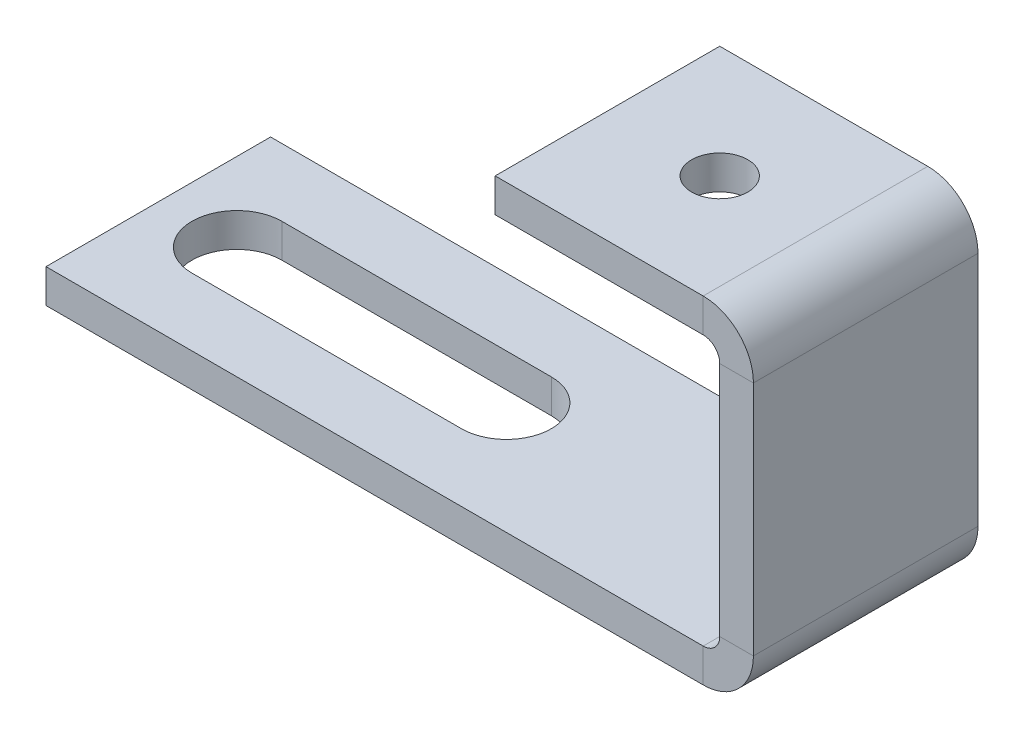
ISO-10303-21;
HEADER;
FILE_DESCRIPTION(('STEP AP214'),'2;1');
FILE_NAME('part.step','',(''),(''),'','','');
FILE_SCHEMA(('AUTOMOTIVE_DESIGN { 1 0 10303 214 1 1 1 1 }'));
ENDSEC;
DATA;
#1=APPLICATION_CONTEXT('core data for automotive mechanical design processes');
#2=APPLICATION_PROTOCOL_DEFINITION('international standard','automotive_design',2000,#1);
#3=PRODUCT_CONTEXT('',#1,'mechanical');
#4=PRODUCT('Part','Part','',(#3));
#5=PRODUCT_RELATED_PRODUCT_CATEGORY('part','',(#4));
#6=PRODUCT_DEFINITION_FORMATION('','',#4);
#7=PRODUCT_DEFINITION_CONTEXT('part definition',#1,'design');
#8=PRODUCT_DEFINITION('design','',#6,#7);
#9=PRODUCT_DEFINITION_SHAPE('','',#8);
#10=(LENGTH_UNIT() NAMED_UNIT(*) SI_UNIT(.MILLI.,.METRE.));
#11=(NAMED_UNIT(*) PLANE_ANGLE_UNIT() SI_UNIT($,.RADIAN.));
#12=(NAMED_UNIT(*) SI_UNIT($,.STERADIAN.) SOLID_ANGLE_UNIT());
#13=UNCERTAINTY_MEASURE_WITH_UNIT(LENGTH_MEASURE(1.E-05),#10,'distance_accuracy_value','');
#14=(GEOMETRIC_REPRESENTATION_CONTEXT(3) GLOBAL_UNCERTAINTY_ASSIGNED_CONTEXT((#13)) GLOBAL_UNIT_ASSIGNED_CONTEXT((#10,
#11,#12)) REPRESENTATION_CONTEXT('',''));
#15=CARTESIAN_POINT('',(0.,0.,0.));
#16=DIRECTION('',(0.,0.,1.));
#17=DIRECTION('',(1.,0.,0.));
#18=AXIS2_PLACEMENT_3D('',#15,#16,#17);
#19=CARTESIAN_POINT('',(0.,-1.5,10.));
#20=DIRECTION('',(0.,1.,0.));
#21=DIRECTION('',(-1.,0.,0.));
#22=AXIS2_PLACEMENT_3D('',#19,#20,#21);
#23=PLANE('',#22);
#24=DIRECTION('',(1.,0.,0.));
#25=VECTOR('',#24,1.);
#26=CARTESIAN_POINT('',(0.,-1.5,0.));
#27=LINE('',#26,#25);
#28=CARTESIAN_POINT('',(-30.,-1.5,0.));
#29=VERTEX_POINT('',#28);
#30=CARTESIAN_POINT('',(-0.7366,-1.5,0.));
#31=VERTEX_POINT('',#30);
#32=EDGE_CURVE('E205',#29,#31,#27,.T.);
#33=ORIENTED_EDGE('',*,*,#32,.T.);
#34=DIRECTION('',(0.,0.,-1.));
#35=VECTOR('',#34,1.);
#36=CARTESIAN_POINT('',(-0.7366,-1.5,10.));
#37=LINE('',#36,#35);
#38=CARTESIAN_POINT('',(-0.7366,-1.5,10.));
#39=VERTEX_POINT('',#38);
#40=EDGE_CURVE('E169',#39,#31,#37,.T.);
#41=ORIENTED_EDGE('',*,*,#40,.F.);
#42=DIRECTION('',(1.,0.,0.));
#43=VECTOR('',#42,1.);
#44=CARTESIAN_POINT('',(0.,-1.5,10.));
#45=LINE('',#44,#43);
#46=CARTESIAN_POINT('',(-30.,-1.5,10.));
#47=VERTEX_POINT('',#46);
#48=EDGE_CURVE('E158',#47,#39,#45,.T.);
#49=ORIENTED_EDGE('',*,*,#48,.F.);
#50=DIRECTION('',(0.,0.,-1.));
#51=VECTOR('',#50,1.);
#52=CARTESIAN_POINT('',(-30.,-1.5,10.));
#53=LINE('',#52,#51);
#54=EDGE_CURVE('E217',#47,#29,#53,.T.);
#55=ORIENTED_EDGE('',*,*,#54,.T.);
#56=EDGE_LOOP('',(#33,#41,#49,#55));
#57=FACE_BOUND('',#56,.T.);
#58=DIRECTION('',(1.,0.,0.));
#59=VECTOR('',#58,1.);
#60=CARTESIAN_POINT('',(0.,-1.5,7.));
#61=LINE('',#60,#59);
#62=CARTESIAN_POINT('',(-26.5,-1.5,7.));
#63=VERTEX_POINT('',#62);
#64=CARTESIAN_POINT('',(-14.5,-1.5,7.));
#65=VERTEX_POINT('',#64);
#66=EDGE_CURVE('E288',#63,#65,#61,.T.);
#67=ORIENTED_EDGE('',*,*,#66,.T.);
#68=CARTESIAN_POINT('',(-14.5,-1.5,5.));
#69=DIRECTION('',(0.,1.,0.));
#70=DIRECTION('',(-1.,0.,0.));
#71=AXIS2_PLACEMENT_3D('',#68,#69,#70);
#72=CIRCLE('',#71,2.);
#73=CARTESIAN_POINT('',(-14.5,-1.5,3.));
#74=VERTEX_POINT('',#73);
#75=EDGE_CURVE('E284',#65,#74,#72,.T.);
#76=ORIENTED_EDGE('',*,*,#75,.T.);
#77=DIRECTION('',(-1.,0.,0.));
#78=VECTOR('',#77,1.);
#79=CARTESIAN_POINT('',(0.,-1.5,3.));
#80=LINE('',#79,#78);
#81=CARTESIAN_POINT('',(-26.5,-1.5,3.));
#82=VERTEX_POINT('',#81);
#83=EDGE_CURVE('E51',#74,#82,#80,.T.);
#84=ORIENTED_EDGE('',*,*,#83,.T.);
#85=CARTESIAN_POINT('',(-26.5,-1.5,5.));
#86=DIRECTION('',(0.,1.,0.));
#87=DIRECTION('',(-1.,0.,0.));
#88=AXIS2_PLACEMENT_3D('',#85,#86,#87);
#89=CIRCLE('',#88,2.);
#90=EDGE_CURVE('E286',#82,#63,#89,.T.);
#91=ORIENTED_EDGE('',*,*,#90,.T.);
#92=EDGE_LOOP('',(#67,#76,#84,#91));
#93=FACE_BOUND('',#92,.T.);
#94=ADVANCED_FACE('F36',(#57,#93),#23,.F.);
#95=CARTESIAN_POINT('',(0.,0.7366,10.));
#96=DIRECTION('',(0.,0.,1.));
#97=DIRECTION('',(1.,0.,0.));
#98=AXIS2_PLACEMENT_3D('',#95,#96,#97);
#99=PLANE('',#98);
#100=DIRECTION('',(1.,0.,0.));
#101=VECTOR('',#100,1.);
#102=CARTESIAN_POINT('',(0.,0.7366,10.));
#103=LINE('',#102,#101);
#104=CARTESIAN_POINT('',(0.,0.7366,10.));
#105=VERTEX_POINT('',#104);
#106=CARTESIAN_POINT('',(1.5,0.7366,10.));
#107=VERTEX_POINT('',#106);
#108=EDGE_CURVE('E11',#105,#107,#103,.T.);
#109=ORIENTED_EDGE('',*,*,#108,.F.);
#110=CARTESIAN_POINT('',(-0.7366,0.7366,10.));
#111=DIRECTION('',(0.,0.,-1.));
#112=DIRECTION('',(-1.,0.,0.));
#113=AXIS2_PLACEMENT_3D('',#110,#111,#112);
#114=CIRCLE('',#113,0.7366);
#115=CARTESIAN_POINT('',(-0.7366,0.,10.));
#116=VERTEX_POINT('',#115);
#117=EDGE_CURVE('E259',#116,#105,#114,.F.);
#118=ORIENTED_EDGE('',*,*,#117,.F.);
#119=DIRECTION('',(0.,1.,0.));
#120=VECTOR('',#119,1.);
#121=CARTESIAN_POINT('',(-0.7366,-1.5,10.));
#122=LINE('',#121,#120);
#123=EDGE_CURVE('E44',#39,#116,#122,.T.);
#124=ORIENTED_EDGE('',*,*,#123,.F.);
#125=CARTESIAN_POINT('',(-0.7366,0.7366,10.));
#126=DIRECTION('',(0.,0.,1.));
#127=DIRECTION('',(1.,0.,0.));
#128=AXIS2_PLACEMENT_3D('',#125,#126,#127);
#129=CIRCLE('',#128,2.2366);
#130=EDGE_CURVE('E153',#39,#107,#129,.T.);
#131=ORIENTED_EDGE('',*,*,#130,.T.);
#132=EDGE_LOOP('',(#109,#118,#124,#131));
#133=FACE_BOUND('',#132,.T.);
#134=ADVANCED_FACE('F38',(#133),#99,.T.);
#135=CARTESIAN_POINT('',(-0.7366,-1.5,10.));
#136=DIRECTION('',(0.,0.,1.));
#137=DIRECTION('',(1.,0.,0.));
#138=AXIS2_PLACEMENT_3D('',#135,#136,#137);
#139=PLANE('',#138);
#140=DIRECTION('',(0.,1.,0.));
#141=VECTOR('',#140,1.);
#142=CARTESIAN_POINT('',(0.,12.,10.));
#143=LINE('',#142,#141);
#144=CARTESIAN_POINT('',(0.,11.2634,10.));
#145=VERTEX_POINT('',#144);
#146=EDGE_CURVE('E147',#105,#145,#143,.T.);
#147=ORIENTED_EDGE('',*,*,#146,.F.);
#148=ORIENTED_EDGE('',*,*,#108,.T.);
#149=DIRECTION('',(0.,1.,0.));
#150=VECTOR('',#149,1.);
#151=CARTESIAN_POINT('',(1.5,12.,10.));
#152=LINE('',#151,#150);
#153=CARTESIAN_POINT('',(1.5,11.2634,10.));
#154=VERTEX_POINT('',#153);
#155=EDGE_CURVE('E144',#107,#154,#152,.T.);
#156=ORIENTED_EDGE('',*,*,#155,.T.);
#157=DIRECTION('',(-1.,0.,0.));
#158=VECTOR('',#157,1.);
#159=CARTESIAN_POINT('',(1.5,11.2634,10.));
#160=LINE('',#159,#158);
#161=EDGE_CURVE('E240',#154,#145,#160,.T.);
#162=ORIENTED_EDGE('',*,*,#161,.T.);
#163=EDGE_LOOP('',(#147,#148,#156,#162));
#164=FACE_BOUND('',#163,.T.);
#165=ADVANCED_FACE('F142',(#164),#139,.T.);
#166=CARTESIAN_POINT('',(-0.7366,0.,0.));
#167=DIRECTION('',(0.,0.,-1.));
#168=DIRECTION('',(-1.,0.,0.));
#169=AXIS2_PLACEMENT_3D('',#166,#167,#168);
#170=PLANE('',#169);
#171=DIRECTION('',(0.,-1.,0.));
#172=VECTOR('',#171,1.);
#173=CARTESIAN_POINT('',(-0.7366,0.,0.));
#174=LINE('',#173,#172);
#175=CARTESIAN_POINT('',(-0.7366,0.,0.));
#176=VERTEX_POINT('',#175);
#177=EDGE_CURVE('E245',#176,#31,#174,.T.);
#178=ORIENTED_EDGE('',*,*,#177,.F.);
#179=CARTESIAN_POINT('',(-0.7366,0.7366,0.));
#180=DIRECTION('',(0.,0.,-1.));
#181=DIRECTION('',(-1.,0.,0.));
#182=AXIS2_PLACEMENT_3D('',#179,#180,#181);
#183=CIRCLE('',#182,0.7366);
#184=CARTESIAN_POINT('',(0.,0.7366,0.));
#185=VERTEX_POINT('',#184);
#186=EDGE_CURVE('E196',#176,#185,#183,.F.);
#187=ORIENTED_EDGE('',*,*,#186,.T.);
#188=DIRECTION('',(-1.,0.,0.));
#189=VECTOR('',#188,1.);
#190=CARTESIAN_POINT('',(1.5,0.7366,0.));
#191=LINE('',#190,#189);
#192=CARTESIAN_POINT('',(1.5,0.7366,0.));
#193=VERTEX_POINT('',#192);
#194=EDGE_CURVE('E243',#193,#185,#191,.T.);
#195=ORIENTED_EDGE('',*,*,#194,.F.);
#196=CARTESIAN_POINT('',(-0.7366,0.7366,0.));
#197=DIRECTION('',(0.,0.,1.));
#198=DIRECTION('',(1.,0.,0.));
#199=AXIS2_PLACEMENT_3D('',#196,#197,#198);
#200=CIRCLE('',#199,2.2366);
#201=EDGE_CURVE('E165',#31,#193,#200,.T.);
#202=ORIENTED_EDGE('',*,*,#201,.F.);
#203=EDGE_LOOP('',(#178,#187,#195,#202));
#204=FACE_BOUND('',#203,.T.);
#205=ADVANCED_FACE('F407',(#204),#170,.T.);
#206=CARTESIAN_POINT('',(1.5,0.7366,0.));
#207=DIRECTION('',(0.,0.,-1.));
#208=DIRECTION('',(-1.,0.,0.));
#209=AXIS2_PLACEMENT_3D('',#206,#207,#208);
#210=PLANE('',#209);
#211=DIRECTION('',(1.,0.,0.));
#212=VECTOR('',#211,1.);
#213=CARTESIAN_POINT('',(0.,0.,0.));
#214=LINE('',#213,#212);
#215=CARTESIAN_POINT('',(-30.,0.,0.));
#216=VERTEX_POINT('',#215);
#217=EDGE_CURVE('E199',#216,#176,#214,.T.);
#218=ORIENTED_EDGE('',*,*,#217,.T.);
#219=ORIENTED_EDGE('',*,*,#177,.T.);
#220=ORIENTED_EDGE('',*,*,#32,.F.);
#221=DIRECTION('',(0.,1.,0.));
#222=VECTOR('',#221,1.);
#223=CARTESIAN_POINT('',(-30.,-1.5,0.));
#224=LINE('',#223,#222);
#225=EDGE_CURVE('E202',#29,#216,#224,.T.);
#226=ORIENTED_EDGE('',*,*,#225,.T.);
#227=EDGE_LOOP('',(#218,#219,#220,#226));
#228=FACE_BOUND('',#227,.T.);
#229=ADVANCED_FACE('F403',(#228),#210,.T.);
#230=CARTESIAN_POINT('',(-0.7366,12.,10.));
#231=DIRECTION('',(0.,0.,1.));
#232=DIRECTION('',(1.,0.,0.));
#233=AXIS2_PLACEMENT_3D('',#230,#231,#232);
#234=PLANE('',#233);
#235=DIRECTION('',(0.,1.,0.));
#236=VECTOR('',#235,1.);
#237=CARTESIAN_POINT('',(-0.7366,12.,10.));
#238=LINE('',#237,#236);
#239=CARTESIAN_POINT('',(-0.7366,12.,10.));
#240=VERTEX_POINT('',#239);
#241=CARTESIAN_POINT('',(-0.7366,13.5,10.));
#242=VERTEX_POINT('',#241);
#243=EDGE_CURVE('E60',#240,#242,#238,.T.);
#244=ORIENTED_EDGE('',*,*,#243,.F.);
#245=CARTESIAN_POINT('',(-0.7366,11.2634,10.));
#246=DIRECTION('',(0.,0.,-1.));
#247=DIRECTION('',(-1.,0.,0.));
#248=AXIS2_PLACEMENT_3D('',#245,#246,#247);
#249=CIRCLE('',#248,0.7366);
#250=EDGE_CURVE('E269',#145,#240,#249,.F.);
#251=ORIENTED_EDGE('',*,*,#250,.F.);
#252=ORIENTED_EDGE('',*,*,#161,.F.);
#253=CARTESIAN_POINT('',(-0.7366,11.2634,10.));
#254=DIRECTION('',(0.,0.,1.));
#255=DIRECTION('',(1.,0.,0.));
#256=AXIS2_PLACEMENT_3D('',#253,#254,#255);
#257=CIRCLE('',#256,2.2366);
#258=EDGE_CURVE('E175',#154,#242,#257,.T.);
#259=ORIENTED_EDGE('',*,*,#258,.T.);
#260=EDGE_LOOP('',(#244,#251,#252,#259));
#261=FACE_BOUND('',#260,.T.);
#262=ADVANCED_FACE('F400',(#261),#234,.T.);
#263=CARTESIAN_POINT('',(1.5,11.2634,10.));
#264=DIRECTION('',(0.,0.,1.));
#265=DIRECTION('',(1.,0.,0.));
#266=AXIS2_PLACEMENT_3D('',#263,#264,#265);
#267=PLANE('',#266);
#268=DIRECTION('',(-1.,0.,0.));
#269=VECTOR('',#268,1.);
#270=CARTESIAN_POINT('',(0.,12.,10.));
#271=LINE('',#270,#269);
#272=CARTESIAN_POINT('',(-10.,12.,10.));
#273=VERTEX_POINT('',#272);
#274=EDGE_CURVE('E272',#240,#273,#271,.T.);
#275=ORIENTED_EDGE('',*,*,#274,.F.);
#276=ORIENTED_EDGE('',*,*,#243,.T.);
#277=DIRECTION('',(-1.,0.,0.));
#278=VECTOR('',#277,1.);
#279=CARTESIAN_POINT('',(0.,13.5,10.));
#280=LINE('',#279,#278);
#281=CARTESIAN_POINT('',(-10.,13.5,10.));
#282=VERTEX_POINT('',#281);
#283=EDGE_CURVE('E112',#242,#282,#280,.T.);
#284=ORIENTED_EDGE('',*,*,#283,.T.);
#285=DIRECTION('',(0.,1.,0.));
#286=VECTOR('',#285,1.);
#287=CARTESIAN_POINT('',(-10.,12.,10.));
#288=LINE('',#287,#286);
#289=EDGE_CURVE('E275',#273,#282,#288,.T.);
#290=ORIENTED_EDGE('',*,*,#289,.F.);
#291=EDGE_LOOP('',(#275,#276,#284,#290));
#292=FACE_BOUND('',#291,.T.);
#293=ADVANCED_FACE('F397',(#292),#267,.T.);
#294=CARTESIAN_POINT('',(0.,11.2634,0.));
#295=DIRECTION('',(0.,0.,-1.));
#296=DIRECTION('',(-1.,0.,0.));
#297=AXIS2_PLACEMENT_3D('',#294,#295,#296);
#298=PLANE('',#297);
#299=DIRECTION('',(1.,0.,0.));
#300=VECTOR('',#299,1.);
#301=CARTESIAN_POINT('',(0.,11.2634,0.));
#302=LINE('',#301,#300);
#303=CARTESIAN_POINT('',(0.,11.2634,0.));
#304=VERTEX_POINT('',#303);
#305=CARTESIAN_POINT('',(1.5,11.2634,0.));
#306=VERTEX_POINT('',#305);
#307=EDGE_CURVE('E238',#304,#306,#302,.T.);
#308=ORIENTED_EDGE('',*,*,#307,.F.);
#309=CARTESIAN_POINT('',(-0.7366,11.2634,0.));
#310=DIRECTION('',(0.,0.,-1.));
#311=DIRECTION('',(-1.,0.,0.));
#312=AXIS2_PLACEMENT_3D('',#309,#310,#311);
#313=CIRCLE('',#312,0.7366);
#314=CARTESIAN_POINT('',(-0.7366,12.,0.));
#315=VERTEX_POINT('',#314);
#316=EDGE_CURVE('E191',#304,#315,#313,.F.);
#317=ORIENTED_EDGE('',*,*,#316,.T.);
#318=DIRECTION('',(0.,-1.,0.));
#319=VECTOR('',#318,1.);
#320=CARTESIAN_POINT('',(-0.7366,13.5,0.));
#321=LINE('',#320,#319);
#322=CARTESIAN_POINT('',(-0.7366,13.5,0.));
#323=VERTEX_POINT('',#322);
#324=EDGE_CURVE('E106',#323,#315,#321,.T.);
#325=ORIENTED_EDGE('',*,*,#324,.F.);
#326=CARTESIAN_POINT('',(-0.7366,11.2634,0.));
#327=DIRECTION('',(0.,0.,1.));
#328=DIRECTION('',(1.,0.,0.));
#329=AXIS2_PLACEMENT_3D('',#326,#327,#328);
#330=CIRCLE('',#329,2.2366);
#331=EDGE_CURVE('E211',#306,#323,#330,.T.);
#332=ORIENTED_EDGE('',*,*,#331,.F.);
#333=EDGE_LOOP('',(#308,#317,#325,#332));
#334=FACE_BOUND('',#333,.T.);
#335=ADVANCED_FACE('F393',(#334),#298,.T.);
#336=CARTESIAN_POINT('',(-0.7366,13.5,0.));
#337=DIRECTION('',(0.,0.,-1.));
#338=DIRECTION('',(-1.,0.,0.));
#339=AXIS2_PLACEMENT_3D('',#336,#337,#338);
#340=PLANE('',#339);
#341=DIRECTION('',(0.,1.,0.));
#342=VECTOR('',#341,1.);
#343=CARTESIAN_POINT('',(0.,12.,0.));
#344=LINE('',#343,#342);
#345=EDGE_CURVE('E193',#185,#304,#344,.T.);
#346=ORIENTED_EDGE('',*,*,#345,.T.);
#347=ORIENTED_EDGE('',*,*,#307,.T.);
#348=DIRECTION('',(0.,1.,0.));
#349=VECTOR('',#348,1.);
#350=CARTESIAN_POINT('',(1.5,12.,0.));
#351=LINE('',#350,#349);
#352=EDGE_CURVE('E209',#193,#306,#351,.T.);
#353=ORIENTED_EDGE('',*,*,#352,.F.);
#354=ORIENTED_EDGE('',*,*,#194,.T.);
#355=EDGE_LOOP('',(#346,#347,#353,#354));
#356=FACE_BOUND('',#355,.T.);
#357=ADVANCED_FACE('F389',(#356),#340,.T.);
#358=CARTESIAN_POINT('',(0.,13.5,10.));
#359=DIRECTION('',(0.,-1.,0.));
#360=DIRECTION('',(1.,0.,0.));
#361=AXIS2_PLACEMENT_3D('',#358,#359,#360);
#362=PLANE('',#361);
#363=CARTESIAN_POINT('',(-5.,13.5,5.));
#364=DIRECTION('',(0.,1.,0.));
#365=DIRECTION('',(0.,0.,1.));
#366=AXIS2_PLACEMENT_3D('',#363,#364,#365);
#367=CIRCLE('',#366,1.25);
#368=CARTESIAN_POINT('',(-5.,13.5,6.25));
#369=VERTEX_POINT('',#368);
#370=EDGE_CURVE('E281',#369,#369,#367,.T.);
#371=ORIENTED_EDGE('',*,*,#370,.F.);
#372=EDGE_LOOP('',(#371));
#373=FACE_BOUND('',#372,.T.);
#374=DIRECTION('',(-1.,0.,0.));
#375=VECTOR('',#374,1.);
#376=CARTESIAN_POINT('',(0.,13.5,0.));
#377=LINE('',#376,#375);
#378=CARTESIAN_POINT('',(-10.,13.5,0.));
#379=VERTEX_POINT('',#378);
#380=EDGE_CURVE('E181',#323,#379,#377,.T.);
#381=ORIENTED_EDGE('',*,*,#380,.T.);
#382=DIRECTION('',(0.,0.,-1.));
#383=VECTOR('',#382,1.);
#384=CARTESIAN_POINT('',(-10.,13.5,10.));
#385=LINE('',#384,#383);
#386=EDGE_CURVE('E235',#282,#379,#385,.T.);
#387=ORIENTED_EDGE('',*,*,#386,.F.);
#388=ORIENTED_EDGE('',*,*,#283,.F.);
#389=DIRECTION('',(0.,0.,-1.));
#390=VECTOR('',#389,1.);
#391=CARTESIAN_POINT('',(-0.7366,13.5,10.));
#392=LINE('',#391,#390);
#393=EDGE_CURVE('E177',#242,#323,#392,.T.);
#394=ORIENTED_EDGE('',*,*,#393,.T.);
#395=EDGE_LOOP('',(#381,#387,#388,#394));
#396=FACE_BOUND('',#395,.T.);
#397=ADVANCED_FACE('F385',(#373,#396),#362,.F.);
#398=CARTESIAN_POINT('',(-10.,12.,10.));
#399=DIRECTION('',(-1.,0.,0.));
#400=DIRECTION('',(0.,0.,1.));
#401=AXIS2_PLACEMENT_3D('',#398,#399,#400);
#402=PLANE('',#401);
#403=DIRECTION('',(0.,1.,0.));
#404=VECTOR('',#403,1.);
#405=CARTESIAN_POINT('',(-10.,12.,0.));
#406=LINE('',#405,#404);
#407=CARTESIAN_POINT('',(-10.,12.,0.));
#408=VERTEX_POINT('',#407);
#409=EDGE_CURVE('E184',#408,#379,#406,.T.);
#410=ORIENTED_EDGE('',*,*,#409,.F.);
#411=DIRECTION('',(0.,0.,-1.));
#412=VECTOR('',#411,1.);
#413=CARTESIAN_POINT('',(-10.,12.,10.));
#414=LINE('',#413,#412);
#415=EDGE_CURVE('E233',#273,#408,#414,.T.);
#416=ORIENTED_EDGE('',*,*,#415,.F.);
#417=ORIENTED_EDGE('',*,*,#289,.T.);
#418=ORIENTED_EDGE('',*,*,#386,.T.);
#419=EDGE_LOOP('',(#410,#416,#417,#418));
#420=FACE_BOUND('',#419,.T.);
#421=ADVANCED_FACE('F381',(#420),#402,.T.);
#422=CARTESIAN_POINT('',(0.,12.,10.));
#423=DIRECTION('',(0.,-1.,0.));
#424=DIRECTION('',(1.,0.,0.));
#425=AXIS2_PLACEMENT_3D('',#422,#423,#424);
#426=PLANE('',#425);
#427=CARTESIAN_POINT('',(-5.,12.,5.));
#428=DIRECTION('',(0.,-1.,0.));
#429=DIRECTION('',(1.,0.,0.));
#430=AXIS2_PLACEMENT_3D('',#427,#428,#429);
#431=CIRCLE('',#430,1.25);
#432=CARTESIAN_POINT('',(-3.75,12.,5.));
#433=VERTEX_POINT('',#432);
#434=EDGE_CURVE('E185',#433,#433,#431,.T.);
#435=ORIENTED_EDGE('',*,*,#434,.F.);
#436=EDGE_LOOP('',(#435));
#437=FACE_BOUND('',#436,.T.);
#438=DIRECTION('',(-1.,0.,0.));
#439=VECTOR('',#438,1.);
#440=CARTESIAN_POINT('',(0.,12.,0.));
#441=LINE('',#440,#439);
#442=EDGE_CURVE('E188',#315,#408,#441,.T.);
#443=ORIENTED_EDGE('',*,*,#442,.F.);
#444=DIRECTION('',(0.,0.,-1.));
#445=VECTOR('',#444,1.);
#446=CARTESIAN_POINT('',(-0.7366,12.,10.));
#447=LINE('',#446,#445);
#448=EDGE_CURVE('E230',#240,#315,#447,.T.);
#449=ORIENTED_EDGE('',*,*,#448,.F.);
#450=ORIENTED_EDGE('',*,*,#274,.T.);
#451=ORIENTED_EDGE('',*,*,#415,.T.);
#452=EDGE_LOOP('',(#443,#449,#450,#451));
#453=FACE_BOUND('',#452,.T.);
#454=ADVANCED_FACE('F377',(#437,#453),#426,.T.);
#455=CARTESIAN_POINT('',(-0.7366,11.2634,10.));
#456=DIRECTION('',(0.,0.,-1.));
#457=DIRECTION('',(-1.,0.,0.));
#458=AXIS2_PLACEMENT_3D('',#455,#456,#457);
#459=CYLINDRICAL_SURFACE('',#458,0.7366);
#460=ORIENTED_EDGE('',*,*,#316,.F.);
#461=DIRECTION('',(0.,0.,-1.));
#462=VECTOR('',#461,1.);
#463=CARTESIAN_POINT('',(0.,11.2634,10.));
#464=LINE('',#463,#462);
#465=EDGE_CURVE('E227',#145,#304,#464,.T.);
#466=ORIENTED_EDGE('',*,*,#465,.F.);
#467=ORIENTED_EDGE('',*,*,#250,.T.);
#468=ORIENTED_EDGE('',*,*,#448,.T.);
#469=EDGE_LOOP('',(#460,#466,#467,#468));
#470=FACE_BOUND('',#469,.T.);
#471=ADVANCED_FACE('F373',(#470),#459,.F.);
#472=CARTESIAN_POINT('',(0.,12.,10.));
#473=DIRECTION('',(-1.,0.,0.));
#474=DIRECTION('',(0.,-1.,0.));
#475=AXIS2_PLACEMENT_3D('',#472,#473,#474);
#476=PLANE('',#475);
#477=ORIENTED_EDGE('',*,*,#345,.F.);
#478=DIRECTION('',(0.,0.,-1.));
#479=VECTOR('',#478,1.);
#480=CARTESIAN_POINT('',(0.,0.7366,10.));
#481=LINE('',#480,#479);
#482=EDGE_CURVE('E224',#105,#185,#481,.T.);
#483=ORIENTED_EDGE('',*,*,#482,.F.);
#484=ORIENTED_EDGE('',*,*,#146,.T.);
#485=ORIENTED_EDGE('',*,*,#465,.T.);
#486=EDGE_LOOP('',(#477,#483,#484,#485));
#487=FACE_BOUND('',#486,.T.);
#488=ADVANCED_FACE('F370',(#487),#476,.T.);
#489=CARTESIAN_POINT('',(-0.7366,0.7366,10.));
#490=DIRECTION('',(0.,0.,-1.));
#491=DIRECTION('',(-1.,0.,0.));
#492=AXIS2_PLACEMENT_3D('',#489,#490,#491);
#493=CYLINDRICAL_SURFACE('',#492,0.7366);
#494=ORIENTED_EDGE('',*,*,#186,.F.);
#495=DIRECTION('',(0.,0.,-1.));
#496=VECTOR('',#495,1.);
#497=CARTESIAN_POINT('',(-0.7366,0.,10.));
#498=LINE('',#497,#496);
#499=EDGE_CURVE('E221',#116,#176,#498,.T.);
#500=ORIENTED_EDGE('',*,*,#499,.F.);
#501=ORIENTED_EDGE('',*,*,#117,.T.);
#502=ORIENTED_EDGE('',*,*,#482,.T.);
#503=EDGE_LOOP('',(#494,#500,#501,#502));
#504=FACE_BOUND('',#503,.T.);
#505=ADVANCED_FACE('F258',(#504),#493,.F.);
#506=CARTESIAN_POINT('',(0.,0.,10.));
#507=DIRECTION('',(0.,1.,0.));
#508=DIRECTION('',(-1.,0.,0.));
#509=AXIS2_PLACEMENT_3D('',#506,#507,#508);
#510=PLANE('',#509);
#511=DIRECTION('',(1.,0.,0.));
#512=VECTOR('',#511,1.);
#513=CARTESIAN_POINT('',(-14.5,0.,7.));
#514=LINE('',#513,#512);
#515=CARTESIAN_POINT('',(-26.5,0.,7.));
#516=VERTEX_POINT('',#515);
#517=CARTESIAN_POINT('',(-14.5,0.,7.));
#518=VERTEX_POINT('',#517);
#519=EDGE_CURVE('E297',#516,#518,#514,.T.);
#520=ORIENTED_EDGE('',*,*,#519,.F.);
#521=CARTESIAN_POINT('',(-26.5,0.,5.));
#522=DIRECTION('',(0.,1.,0.));
#523=DIRECTION('',(-1.,0.,0.));
#524=AXIS2_PLACEMENT_3D('',#521,#522,#523);
#525=CIRCLE('',#524,2.);
#526=CARTESIAN_POINT('',(-26.5,0.,3.));
#527=VERTEX_POINT('',#526);
#528=EDGE_CURVE('E307',#527,#516,#525,.T.);
#529=ORIENTED_EDGE('',*,*,#528,.F.);
#530=DIRECTION('',(-1.,0.,0.));
#531=VECTOR('',#530,1.);
#532=CARTESIAN_POINT('',(-14.5,0.,3.));
#533=LINE('',#532,#531);
#534=CARTESIAN_POINT('',(-14.5,0.,3.));
#535=VERTEX_POINT('',#534);
#536=EDGE_CURVE('E310',#535,#527,#533,.T.);
#537=ORIENTED_EDGE('',*,*,#536,.F.);
#538=CARTESIAN_POINT('',(-14.5,0.,5.));
#539=DIRECTION('',(0.,1.,0.));
#540=DIRECTION('',(-1.,0.,0.));
#541=AXIS2_PLACEMENT_3D('',#538,#539,#540);
#542=CIRCLE('',#541,2.);
#543=EDGE_CURVE('E313',#518,#535,#542,.T.);
#544=ORIENTED_EDGE('',*,*,#543,.F.);
#545=EDGE_LOOP('',(#520,#529,#537,#544));
#546=FACE_BOUND('',#545,.T.);
#547=ORIENTED_EDGE('',*,*,#217,.F.);
#548=DIRECTION('',(0.,0.,-1.));
#549=VECTOR('',#548,1.);
#550=CARTESIAN_POINT('',(-30.,0.,10.));
#551=LINE('',#550,#549);
#552=CARTESIAN_POINT('',(-30.,0.,10.));
#553=VERTEX_POINT('',#552);
#554=EDGE_CURVE('E219',#553,#216,#551,.T.);
#555=ORIENTED_EDGE('',*,*,#554,.F.);
#556=DIRECTION('',(1.,0.,0.));
#557=VECTOR('',#556,1.);
#558=CARTESIAN_POINT('',(0.,0.,10.));
#559=LINE('',#558,#557);
#560=EDGE_CURVE('E252',#553,#116,#559,.T.);
#561=ORIENTED_EDGE('',*,*,#560,.T.);
#562=ORIENTED_EDGE('',*,*,#499,.T.);
#563=EDGE_LOOP('',(#547,#555,#561,#562));
#564=FACE_BOUND('',#563,.T.);
#565=ADVANCED_FACE('F263',(#546,#564),#510,.T.);
#566=CARTESIAN_POINT('',(-30.,-1.5,10.));
#567=DIRECTION('',(-1.,0.,0.));
#568=DIRECTION('',(0.,0.,1.));
#569=AXIS2_PLACEMENT_3D('',#566,#567,#568);
#570=PLANE('',#569);
#571=ORIENTED_EDGE('',*,*,#225,.F.);
#572=ORIENTED_EDGE('',*,*,#54,.F.);
#573=DIRECTION('',(0.,1.,0.));
#574=VECTOR('',#573,1.);
#575=CARTESIAN_POINT('',(-30.,-1.5,10.));
#576=LINE('',#575,#574);
#577=EDGE_CURVE('E264',#47,#553,#576,.T.);
#578=ORIENTED_EDGE('',*,*,#577,.T.);
#579=ORIENTED_EDGE('',*,*,#554,.T.);
#580=EDGE_LOOP('',(#571,#572,#578,#579));
#581=FACE_BOUND('',#580,.T.);
#582=ADVANCED_FACE('F362',(#581),#570,.T.);
#583=CARTESIAN_POINT('',(-0.7366,0.7366,10.));
#584=DIRECTION('',(0.,0.,-1.));
#585=DIRECTION('',(-1.,0.,0.));
#586=AXIS2_PLACEMENT_3D('',#583,#584,#585);
#587=CYLINDRICAL_SURFACE('',#586,2.2366);
#588=ORIENTED_EDGE('',*,*,#201,.T.);
#589=DIRECTION('',(0.,0.,-1.));
#590=VECTOR('',#589,1.);
#591=CARTESIAN_POINT('',(1.5,0.7366,10.));
#592=LINE('',#591,#590);
#593=EDGE_CURVE('E162',#107,#193,#592,.T.);
#594=ORIENTED_EDGE('',*,*,#593,.F.);
#595=ORIENTED_EDGE('',*,*,#130,.F.);
#596=ORIENTED_EDGE('',*,*,#40,.T.);
#597=EDGE_LOOP('',(#588,#594,#595,#596));
#598=FACE_BOUND('',#597,.T.);
#599=ADVANCED_FACE('F163',(#598),#587,.T.);
#600=CARTESIAN_POINT('',(1.5,12.,10.));
#601=DIRECTION('',(-1.,0.,0.));
#602=DIRECTION('',(0.,-1.,0.));
#603=AXIS2_PLACEMENT_3D('',#600,#601,#602);
#604=PLANE('',#603);
#605=ORIENTED_EDGE('',*,*,#352,.T.);
#606=DIRECTION('',(0.,0.,-1.));
#607=VECTOR('',#606,1.);
#608=CARTESIAN_POINT('',(1.5,11.2634,10.));
#609=LINE('',#608,#607);
#610=EDGE_CURVE('E170',#154,#306,#609,.T.);
#611=ORIENTED_EDGE('',*,*,#610,.F.);
#612=ORIENTED_EDGE('',*,*,#155,.F.);
#613=ORIENTED_EDGE('',*,*,#593,.T.);
#614=EDGE_LOOP('',(#605,#611,#612,#613));
#615=FACE_BOUND('',#614,.T.);
#616=ADVANCED_FACE('F172',(#615),#604,.F.);
#617=CARTESIAN_POINT('',(-0.7366,11.2634,10.));
#618=DIRECTION('',(0.,0.,-1.));
#619=DIRECTION('',(-1.,0.,0.));
#620=AXIS2_PLACEMENT_3D('',#617,#618,#619);
#621=CYLINDRICAL_SURFACE('',#620,2.2366);
#622=ORIENTED_EDGE('',*,*,#331,.T.);
#623=ORIENTED_EDGE('',*,*,#393,.F.);
#624=ORIENTED_EDGE('',*,*,#258,.F.);
#625=ORIENTED_EDGE('',*,*,#610,.T.);
#626=EDGE_LOOP('',(#622,#623,#624,#625));
#627=FACE_BOUND('',#626,.T.);
#628=ADVANCED_FACE('F486',(#627),#621,.T.);
#629=CARTESIAN_POINT('',(-0.7366,11.2634,10.));
#630=DIRECTION('',(0.,0.,-1.));
#631=DIRECTION('',(-1.,0.,0.));
#632=AXIS2_PLACEMENT_3D('',#629,#630,#631);
#633=PLANE('',#632);
#634=ORIENTED_EDGE('',*,*,#48,.T.);
#635=ORIENTED_EDGE('',*,*,#123,.T.);
#636=ORIENTED_EDGE('',*,*,#560,.F.);
#637=ORIENTED_EDGE('',*,*,#577,.F.);
#638=EDGE_LOOP('',(#634,#635,#636,#637));
#639=FACE_BOUND('',#638,.T.);
#640=ADVANCED_FACE('F249',(#639),#633,.F.);
#641=CARTESIAN_POINT('',(-0.7366,11.2634,0.));
#642=DIRECTION('',(0.,0.,-1.));
#643=DIRECTION('',(-1.,0.,0.));
#644=AXIS2_PLACEMENT_3D('',#641,#642,#643);
#645=PLANE('',#644);
#646=ORIENTED_EDGE('',*,*,#380,.F.);
#647=ORIENTED_EDGE('',*,*,#324,.T.);
#648=ORIENTED_EDGE('',*,*,#442,.T.);
#649=ORIENTED_EDGE('',*,*,#409,.T.);
#650=EDGE_LOOP('',(#646,#647,#648,#649));
#651=FACE_BOUND('',#650,.T.);
#652=ADVANCED_FACE('F499',(#651),#645,.T.);
#653=CARTESIAN_POINT('',(-5.,13.5,5.));
#654=DIRECTION('',(0.,1.,0.));
#655=DIRECTION('',(0.,0.,1.));
#656=AXIS2_PLACEMENT_3D('',#653,#654,#655);
#657=CYLINDRICAL_SURFACE('',#656,1.25);
#658=ORIENTED_EDGE('',*,*,#370,.T.);
#659=EDGE_LOOP('',(#658));
#660=FACE_BOUND('',#659,.T.);
#661=ORIENTED_EDGE('',*,*,#434,.T.);
#662=EDGE_LOOP('',(#661));
#663=FACE_BOUND('',#662,.T.);
#664=ADVANCED_FACE('F505',(#660,#663),#657,.F.);
#665=CARTESIAN_POINT('',(-14.5,-10.,5.));
#666=DIRECTION('',(0.,1.,0.));
#667=DIRECTION('',(-1.,0.,0.));
#668=AXIS2_PLACEMENT_3D('',#665,#666,#667);
#669=CYLINDRICAL_SURFACE('',#668,2.);
#670=DIRECTION('',(0.,1.,0.));
#671=VECTOR('',#670,1.);
#672=CARTESIAN_POINT('',(-14.5,-10.,7.));
#673=LINE('',#672,#671);
#674=EDGE_CURVE('E292',#65,#518,#673,.T.);
#675=ORIENTED_EDGE('',*,*,#674,.T.);
#676=ORIENTED_EDGE('',*,*,#543,.T.);
#677=DIRECTION('',(0.,1.,0.));
#678=VECTOR('',#677,1.);
#679=CARTESIAN_POINT('',(-14.5,-10.,3.));
#680=LINE('',#679,#678);
#681=EDGE_CURVE('E293',#74,#535,#680,.T.);
#682=ORIENTED_EDGE('',*,*,#681,.F.);
#683=ORIENTED_EDGE('',*,*,#75,.F.);
#684=EDGE_LOOP('',(#675,#676,#682,#683));
#685=FACE_BOUND('',#684,.T.);
#686=ADVANCED_FACE('F320',(#685),#669,.F.);
#687=CARTESIAN_POINT('',(-26.5,-10.,5.));
#688=DIRECTION('',(0.,1.,0.));
#689=DIRECTION('',(-1.,0.,0.));
#690=AXIS2_PLACEMENT_3D('',#687,#688,#689);
#691=CYLINDRICAL_SURFACE('',#690,2.);
#692=DIRECTION('',(0.,1.,0.));
#693=VECTOR('',#692,1.);
#694=CARTESIAN_POINT('',(-26.5,-10.,3.));
#695=LINE('',#694,#693);
#696=EDGE_CURVE('E296',#82,#527,#695,.T.);
#697=ORIENTED_EDGE('',*,*,#696,.T.);
#698=ORIENTED_EDGE('',*,*,#528,.T.);
#699=DIRECTION('',(0.,1.,0.));
#700=VECTOR('',#699,1.);
#701=CARTESIAN_POINT('',(-26.5,-10.,7.));
#702=LINE('',#701,#700);
#703=EDGE_CURVE('E300',#63,#516,#702,.T.);
#704=ORIENTED_EDGE('',*,*,#703,.F.);
#705=ORIENTED_EDGE('',*,*,#90,.F.);
#706=EDGE_LOOP('',(#697,#698,#704,#705));
#707=FACE_BOUND('',#706,.T.);
#708=ADVANCED_FACE('F336',(#707),#691,.F.);
#709=CARTESIAN_POINT('',(-14.5,-10.,7.));
#710=DIRECTION('',(0.,0.,1.));
#711=DIRECTION('',(1.,0.,0.));
#712=AXIS2_PLACEMENT_3D('',#709,#710,#711);
#713=PLANE('',#712);
#714=ORIENTED_EDGE('',*,*,#703,.T.);
#715=ORIENTED_EDGE('',*,*,#519,.T.);
#716=ORIENTED_EDGE('',*,*,#674,.F.);
#717=ORIENTED_EDGE('',*,*,#66,.F.);
#718=EDGE_LOOP('',(#714,#715,#716,#717));
#719=FACE_BOUND('',#718,.T.);
#720=ADVANCED_FACE('F344',(#719),#713,.F.);
#721=CARTESIAN_POINT('',(-14.5,-10.,3.));
#722=DIRECTION('',(0.,0.,-1.));
#723=DIRECTION('',(-1.,0.,0.));
#724=AXIS2_PLACEMENT_3D('',#721,#722,#723);
#725=PLANE('',#724);
#726=ORIENTED_EDGE('',*,*,#681,.T.);
#727=ORIENTED_EDGE('',*,*,#536,.T.);
#728=ORIENTED_EDGE('',*,*,#696,.F.);
#729=ORIENTED_EDGE('',*,*,#83,.F.);
#730=EDGE_LOOP('',(#726,#727,#728,#729));
#731=FACE_BOUND('',#730,.T.);
#732=ADVANCED_FACE('F331',(#731),#725,.F.);
#733=CLOSED_SHELL('',(#94,#134,#165,#205,#229,#262,#293,#335,#357,#397,#421,#454,#471,#488,#505,
#565,#582,#599,#616,#628,#640,#652,#664,#686,#708,#720,#732));
#734=MANIFOLD_SOLID_BREP('B2',#733);
#735=ADVANCED_BREP_SHAPE_REPRESENTATION('',(#18,#734),#14);
#736=SHAPE_DEFINITION_REPRESENTATION(#9,#735);
ENDSEC;
END-ISO-10303-21;
